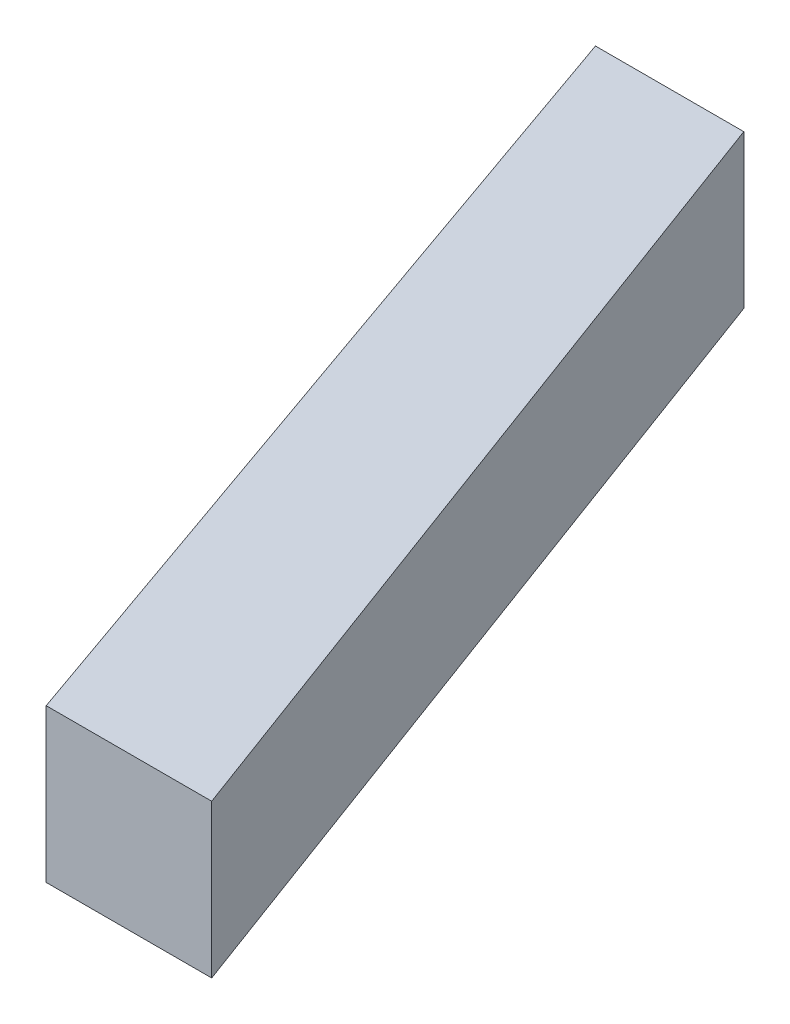
ISO-10303-21;
HEADER;
FILE_DESCRIPTION(('STEP AP214'),'2;1');
FILE_NAME('part.step','',(''),(''),'','','');
FILE_SCHEMA(('AUTOMOTIVE_DESIGN { 1 0 10303 214 1 1 1 1 }'));
ENDSEC;
DATA;
#1=APPLICATION_CONTEXT('core data for automotive mechanical design processes');
#2=APPLICATION_PROTOCOL_DEFINITION('international standard','automotive_design',2000,#1);
#3=PRODUCT_CONTEXT('',#1,'mechanical');
#4=PRODUCT('Part','Part','',(#3));
#5=PRODUCT_RELATED_PRODUCT_CATEGORY('part','',(#4));
#6=PRODUCT_DEFINITION_FORMATION('','',#4);
#7=PRODUCT_DEFINITION_CONTEXT('part definition',#1,'design');
#8=PRODUCT_DEFINITION('design','',#6,#7);
#9=PRODUCT_DEFINITION_SHAPE('','',#8);
#10=(LENGTH_UNIT() NAMED_UNIT(*) SI_UNIT(.MILLI.,.METRE.));
#11=(NAMED_UNIT(*) PLANE_ANGLE_UNIT() SI_UNIT($,.RADIAN.));
#12=(NAMED_UNIT(*) SI_UNIT($,.STERADIAN.) SOLID_ANGLE_UNIT());
#13=UNCERTAINTY_MEASURE_WITH_UNIT(LENGTH_MEASURE(1.E-05),#10,'distance_accuracy_value','');
#14=(GEOMETRIC_REPRESENTATION_CONTEXT(3) GLOBAL_UNCERTAINTY_ASSIGNED_CONTEXT((#13)) GLOBAL_UNIT_ASSIGNED_CONTEXT((#10,
#11,#12)) REPRESENTATION_CONTEXT('',''));
#15=CARTESIAN_POINT('',(0.,0.,0.));
#16=DIRECTION('',(0.,0.,1.));
#17=DIRECTION('',(1.,0.,0.));
#18=AXIS2_PLACEMENT_3D('',#15,#16,#17);
#19=CARTESIAN_POINT('',(145.088524740877,10.,-207.227493118435));
#20=DIRECTION('',(0.,0.,1.));
#21=DIRECTION('',(1.,0.,0.));
#22=AXIS2_PLACEMENT_3D('',#19,#20,#21);
#23=PLANE('',#22);
#24=DIRECTION('',(-1.,0.,0.));
#25=VECTOR('',#24,1.);
#26=CARTESIAN_POINT('',(145.088524740877,0.,-207.227493118435));
#27=LINE('',#26,#25);
#28=CARTESIAN_POINT('',(145.088524740877,0.,-207.227493118435));
#29=VERTEX_POINT('',#28);
#30=CARTESIAN_POINT('',(135.398328528165,0.,-207.227493118435));
#31=VERTEX_POINT('',#30);
#32=EDGE_CURVE('E93',#29,#31,#27,.T.);
#33=ORIENTED_EDGE('',*,*,#32,.T.);
#34=DIRECTION('',(0.,-1.,0.));
#35=VECTOR('',#34,1.);
#36=CARTESIAN_POINT('',(135.398328528165,10.,-207.227493118435));
#37=LINE('',#36,#35);
#38=CARTESIAN_POINT('',(135.398328528165,10.,-207.227493118435));
#39=VERTEX_POINT('',#38);
#40=EDGE_CURVE('E11',#39,#31,#37,.T.);
#41=ORIENTED_EDGE('',*,*,#40,.F.);
#42=DIRECTION('',(-1.,0.,0.));
#43=VECTOR('',#42,1.);
#44=CARTESIAN_POINT('',(145.088524740877,10.,-207.227493118435));
#45=LINE('',#44,#43);
#46=CARTESIAN_POINT('',(145.088524740877,10.,-207.227493118435));
#47=VERTEX_POINT('',#46);
#48=EDGE_CURVE('E81',#47,#39,#45,.T.);
#49=ORIENTED_EDGE('',*,*,#48,.F.);
#50=DIRECTION('',(0.,-1.,0.));
#51=VECTOR('',#50,1.);
#52=CARTESIAN_POINT('',(145.088524740877,10.,-207.227493118435));
#53=LINE('',#52,#51);
#54=EDGE_CURVE('E89',#47,#29,#53,.T.);
#55=ORIENTED_EDGE('',*,*,#54,.T.);
#56=EDGE_LOOP('',(#33,#41,#49,#55));
#57=FACE_BOUND('',#56,.T.);
#58=ADVANCED_FACE('F30',(#57),#23,.F.);
#59=CARTESIAN_POINT('',(135.398328528165,10.,-207.227493118435));
#60=DIRECTION('',(0.94364698127372,0.,-0.33095373503406));
#61=DIRECTION('',(-0.33095373503406,0.,-0.943646981273721));
#62=AXIS2_PLACEMENT_3D('',#59,#60,#61);
#63=PLANE('',#62);
#64=DIRECTION('',(0.33095373503406,0.,0.94364698127372));
#65=VECTOR('',#64,1.);
#66=CARTESIAN_POINT('',(135.398328528165,0.,-207.227493118435));
#67=LINE('',#66,#65);
#68=CARTESIAN_POINT('',(154.778720953589,0.,-151.968262379523));
#69=VERTEX_POINT('',#68);
#70=EDGE_CURVE('E85',#31,#69,#67,.T.);
#71=ORIENTED_EDGE('',*,*,#70,.T.);
#72=DIRECTION('',(0.,-1.,0.));
#73=VECTOR('',#72,1.);
#74=CARTESIAN_POINT('',(154.778720953589,10.,-151.968262379523));
#75=LINE('',#74,#73);
#76=CARTESIAN_POINT('',(154.778720953589,10.,-151.968262379523));
#77=VERTEX_POINT('',#76);
#78=EDGE_CURVE('E38',#77,#69,#75,.T.);
#79=ORIENTED_EDGE('',*,*,#78,.F.);
#80=DIRECTION('',(0.33095373503406,0.,0.94364698127372));
#81=VECTOR('',#80,1.);
#82=CARTESIAN_POINT('',(135.398328528165,10.,-207.227493118435));
#83=LINE('',#82,#81);
#84=EDGE_CURVE('E76',#39,#77,#83,.T.);
#85=ORIENTED_EDGE('',*,*,#84,.F.);
#86=ORIENTED_EDGE('',*,*,#40,.T.);
#87=EDGE_LOOP('',(#71,#79,#85,#86));
#88=FACE_BOUND('',#87,.T.);
#89=ADVANCED_FACE('F84',(#88),#63,.F.);
#90=CARTESIAN_POINT('',(154.778720953589,10.,-151.968262379523));
#91=DIRECTION('',(0.,0.,-1.));
#92=DIRECTION('',(-1.,0.,0.));
#93=AXIS2_PLACEMENT_3D('',#90,#91,#92);
#94=PLANE('',#93);
#95=DIRECTION('',(1.,0.,0.));
#96=VECTOR('',#95,1.);
#97=CARTESIAN_POINT('',(154.778720953589,0.,-151.968262379523));
#98=LINE('',#97,#96);
#99=CARTESIAN_POINT('',(165.588889592896,0.,-151.968262379523));
#100=VERTEX_POINT('',#99);
#101=EDGE_CURVE('E63',#69,#100,#98,.T.);
#102=ORIENTED_EDGE('',*,*,#101,.T.);
#103=DIRECTION('',(0.,-1.,0.));
#104=VECTOR('',#103,1.);
#105=CARTESIAN_POINT('',(165.588889592896,10.,-151.968262379523));
#106=LINE('',#105,#104);
#107=CARTESIAN_POINT('',(165.588889592896,10.,-151.968262379523));
#108=VERTEX_POINT('',#107);
#109=EDGE_CURVE('E86',#108,#100,#106,.T.);
#110=ORIENTED_EDGE('',*,*,#109,.F.);
#111=DIRECTION('',(1.,0.,0.));
#112=VECTOR('',#111,1.);
#113=CARTESIAN_POINT('',(154.778720953589,10.,-151.968262379523));
#114=LINE('',#113,#112);
#115=EDGE_CURVE('E79',#77,#108,#114,.T.);
#116=ORIENTED_EDGE('',*,*,#115,.F.);
#117=ORIENTED_EDGE('',*,*,#78,.T.);
#118=EDGE_LOOP('',(#102,#110,#116,#117));
#119=FACE_BOUND('',#118,.T.);
#120=ADVANCED_FACE('F87',(#119),#94,.F.);
#121=CARTESIAN_POINT('',(165.588889592896,10.,-151.968262379523));
#122=DIRECTION('',(-0.937560836096946,0.,0.347821331457972));
#123=DIRECTION('',(0.347821331457972,0.,0.937560836096946));
#124=AXIS2_PLACEMENT_3D('',#121,#122,#123);
#125=PLANE('',#124);
#126=DIRECTION('',(-0.347821331457972,0.,-0.937560836096946));
#127=VECTOR('',#126,1.);
#128=CARTESIAN_POINT('',(165.588889592896,0.,-151.968262379523));
#129=LINE('',#128,#127);
#130=EDGE_CURVE('E69',#100,#29,#129,.T.);
#131=ORIENTED_EDGE('',*,*,#130,.T.);
#132=ORIENTED_EDGE('',*,*,#54,.F.);
#133=DIRECTION('',(-0.347821331457972,0.,-0.937560836096946));
#134=VECTOR('',#133,1.);
#135=CARTESIAN_POINT('',(165.588889592896,10.,-151.968262379523));
#136=LINE('',#135,#134);
#137=EDGE_CURVE('E46',#108,#47,#136,.T.);
#138=ORIENTED_EDGE('',*,*,#137,.F.);
#139=ORIENTED_EDGE('',*,*,#109,.T.);
#140=EDGE_LOOP('',(#131,#132,#138,#139));
#141=FACE_BOUND('',#140,.T.);
#142=ADVANCED_FACE('F100',(#141),#125,.F.);
#143=CARTESIAN_POINT('',(0.,10.,0.));
#144=DIRECTION('',(0.,1.,0.));
#145=DIRECTION('',(0.,0.,1.));
#146=AXIS2_PLACEMENT_3D('',#143,#144,#145);
#147=PLANE('',#146);
#148=ORIENTED_EDGE('',*,*,#48,.T.);
#149=ORIENTED_EDGE('',*,*,#84,.T.);
#150=ORIENTED_EDGE('',*,*,#115,.T.);
#151=ORIENTED_EDGE('',*,*,#137,.T.);
#152=EDGE_LOOP('',(#148,#149,#150,#151));
#153=FACE_BOUND('',#152,.T.);
#154=ADVANCED_FACE('F77',(#153),#147,.T.);
#155=CARTESIAN_POINT('',(0.,0.,0.));
#156=DIRECTION('',(0.,1.,0.));
#157=DIRECTION('',(0.,0.,1.));
#158=AXIS2_PLACEMENT_3D('',#155,#156,#157);
#159=PLANE('',#158);
#160=ORIENTED_EDGE('',*,*,#32,.F.);
#161=ORIENTED_EDGE('',*,*,#130,.F.);
#162=ORIENTED_EDGE('',*,*,#101,.F.);
#163=ORIENTED_EDGE('',*,*,#70,.F.);
#164=EDGE_LOOP('',(#160,#161,#162,#163));
#165=FACE_BOUND('',#164,.T.);
#166=ADVANCED_FACE('F103',(#165),#159,.F.);
#167=CLOSED_SHELL('',(#58,#89,#120,#142,#154,#166));
#168=MANIFOLD_SOLID_BREP('B2',#167);
#169=ADVANCED_BREP_SHAPE_REPRESENTATION('',(#18,#168),#14);
#170=SHAPE_DEFINITION_REPRESENTATION(#9,#169);
ENDSEC;
END-ISO-10303-21;
